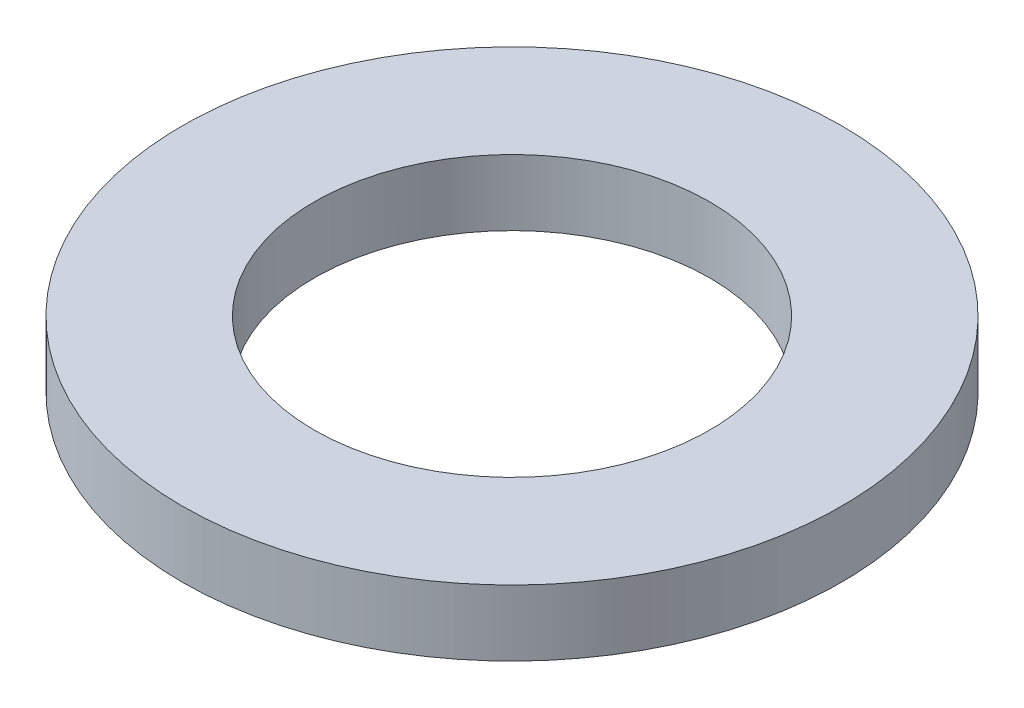
ISO-10303-21;
HEADER;
FILE_DESCRIPTION(('STEP AP214'),'2;1');
FILE_NAME('part.step','',(''),(''),'','','');
FILE_SCHEMA(('AUTOMOTIVE_DESIGN { 1 0 10303 214 1 1 1 1 }'));
ENDSEC;
DATA;
#1=APPLICATION_CONTEXT('core data for automotive mechanical design processes');
#2=APPLICATION_PROTOCOL_DEFINITION('international standard','automotive_design',2000,#1);
#3=PRODUCT_CONTEXT('',#1,'mechanical');
#4=PRODUCT('Part','Part','',(#3));
#5=PRODUCT_RELATED_PRODUCT_CATEGORY('part','',(#4));
#6=PRODUCT_DEFINITION_FORMATION('','',#4);
#7=PRODUCT_DEFINITION_CONTEXT('part definition',#1,'design');
#8=PRODUCT_DEFINITION('design','',#6,#7);
#9=PRODUCT_DEFINITION_SHAPE('','',#8);
#10=(LENGTH_UNIT() NAMED_UNIT(*) SI_UNIT(.MILLI.,.METRE.));
#11=(NAMED_UNIT(*) PLANE_ANGLE_UNIT() SI_UNIT($,.RADIAN.));
#12=(NAMED_UNIT(*) SI_UNIT($,.STERADIAN.) SOLID_ANGLE_UNIT());
#13=UNCERTAINTY_MEASURE_WITH_UNIT(LENGTH_MEASURE(1.E-05),#10,'distance_accuracy_value','');
#14=(GEOMETRIC_REPRESENTATION_CONTEXT(3) GLOBAL_UNCERTAINTY_ASSIGNED_CONTEXT((#13)) GLOBAL_UNIT_ASSIGNED_CONTEXT((#10,
#11,#12)) REPRESENTATION_CONTEXT('',''));
#15=CARTESIAN_POINT('',(0.,0.,0.));
#16=DIRECTION('',(0.,0.,1.));
#17=DIRECTION('',(1.,0.,0.));
#18=AXIS2_PLACEMENT_3D('',#15,#16,#17);
#19=CARTESIAN_POINT('',(0.,3.,0.));
#20=DIRECTION('',(0.,-1.,0.));
#21=DIRECTION('',(0.,0.,-1.));
#22=AXIS2_PLACEMENT_3D('',#19,#20,#21);
#23=CYLINDRICAL_SURFACE('',#22,15.);
#24=CARTESIAN_POINT('',(0.,3.,0.));
#25=DIRECTION('',(0.,1.,0.));
#26=DIRECTION('',(0.,0.,1.));
#27=AXIS2_PLACEMENT_3D('',#24,#25,#26);
#28=CIRCLE('',#27,15.);
#29=CARTESIAN_POINT('',(0.,3.,15.));
#30=VERTEX_POINT('',#29);
#31=EDGE_CURVE('E10',#30,#30,#28,.T.);
#32=ORIENTED_EDGE('',*,*,#31,.F.);
#33=EDGE_LOOP('',(#32));
#34=FACE_BOUND('',#33,.T.);
#35=CARTESIAN_POINT('',(0.,0.,0.));
#36=DIRECTION('',(0.,1.,0.));
#37=DIRECTION('',(0.,0.,1.));
#38=AXIS2_PLACEMENT_3D('',#35,#36,#37);
#39=CIRCLE('',#38,15.);
#40=CARTESIAN_POINT('',(0.,0.,15.));
#41=VERTEX_POINT('',#40);
#42=EDGE_CURVE('E36',#41,#41,#39,.T.);
#43=ORIENTED_EDGE('',*,*,#42,.T.);
#44=EDGE_LOOP('',(#43));
#45=FACE_BOUND('',#44,.T.);
#46=ADVANCED_FACE('F33',(#34,#45),#23,.T.);
#47=CARTESIAN_POINT('',(0.,3.,0.));
#48=DIRECTION('',(0.,1.,0.));
#49=DIRECTION('',(0.,0.,1.));
#50=AXIS2_PLACEMENT_3D('',#47,#48,#49);
#51=PLANE('',#50);
#52=CARTESIAN_POINT('',(0.,3.,0.));
#53=DIRECTION('',(0.,1.,0.));
#54=DIRECTION('',(0.,0.,1.));
#55=AXIS2_PLACEMENT_3D('',#52,#53,#54);
#56=CIRCLE('',#55,9.);
#57=CARTESIAN_POINT('',(0.,3.,9.));
#58=VERTEX_POINT('',#57);
#59=EDGE_CURVE('E43',#58,#58,#56,.T.);
#60=ORIENTED_EDGE('',*,*,#59,.F.);
#61=EDGE_LOOP('',(#60));
#62=FACE_BOUND('',#61,.T.);
#63=ORIENTED_EDGE('',*,*,#31,.T.);
#64=EDGE_LOOP('',(#63));
#65=FACE_BOUND('',#64,.T.);
#66=ADVANCED_FACE('F56',(#62,#65),#51,.T.);
#67=CARTESIAN_POINT('',(0.,0.,0.));
#68=DIRECTION('',(0.,1.,0.));
#69=DIRECTION('',(0.,0.,1.));
#70=AXIS2_PLACEMENT_3D('',#67,#68,#69);
#71=PLANE('',#70);
#72=CARTESIAN_POINT('',(0.,0.,0.));
#73=DIRECTION('',(0.,-1.,0.));
#74=DIRECTION('',(0.,0.,-1.));
#75=AXIS2_PLACEMENT_3D('',#72,#73,#74);
#76=CIRCLE('',#75,9.);
#77=CARTESIAN_POINT('',(0.,0.,-9.));
#78=VERTEX_POINT('',#77);
#79=EDGE_CURVE('E47',#78,#78,#76,.T.);
#80=ORIENTED_EDGE('',*,*,#79,.F.);
#81=EDGE_LOOP('',(#80));
#82=FACE_BOUND('',#81,.T.);
#83=ORIENTED_EDGE('',*,*,#42,.F.);
#84=EDGE_LOOP('',(#83));
#85=FACE_BOUND('',#84,.T.);
#86=ADVANCED_FACE('F53',(#82,#85),#71,.F.);
#87=CARTESIAN_POINT('',(0.,24.5,0.));
#88=DIRECTION('',(0.,-1.,0.));
#89=DIRECTION('',(0.,0.,-1.));
#90=AXIS2_PLACEMENT_3D('',#87,#88,#89);
#91=CYLINDRICAL_SURFACE('',#90,9.);
#92=ORIENTED_EDGE('',*,*,#59,.T.);
#93=EDGE_LOOP('',(#92));
#94=FACE_BOUND('',#93,.T.);
#95=ORIENTED_EDGE('',*,*,#79,.T.);
#96=EDGE_LOOP('',(#95));
#97=FACE_BOUND('',#96,.T.);
#98=ADVANCED_FACE('F51',(#94,#97),#91,.F.);
#99=CLOSED_SHELL('',(#46,#66,#86,#98));
#100=MANIFOLD_SOLID_BREP('B2',#99);
#101=ADVANCED_BREP_SHAPE_REPRESENTATION('',(#18,#100),#14);
#102=SHAPE_DEFINITION_REPRESENTATION(#9,#101);
ENDSEC;
END-ISO-10303-21;
